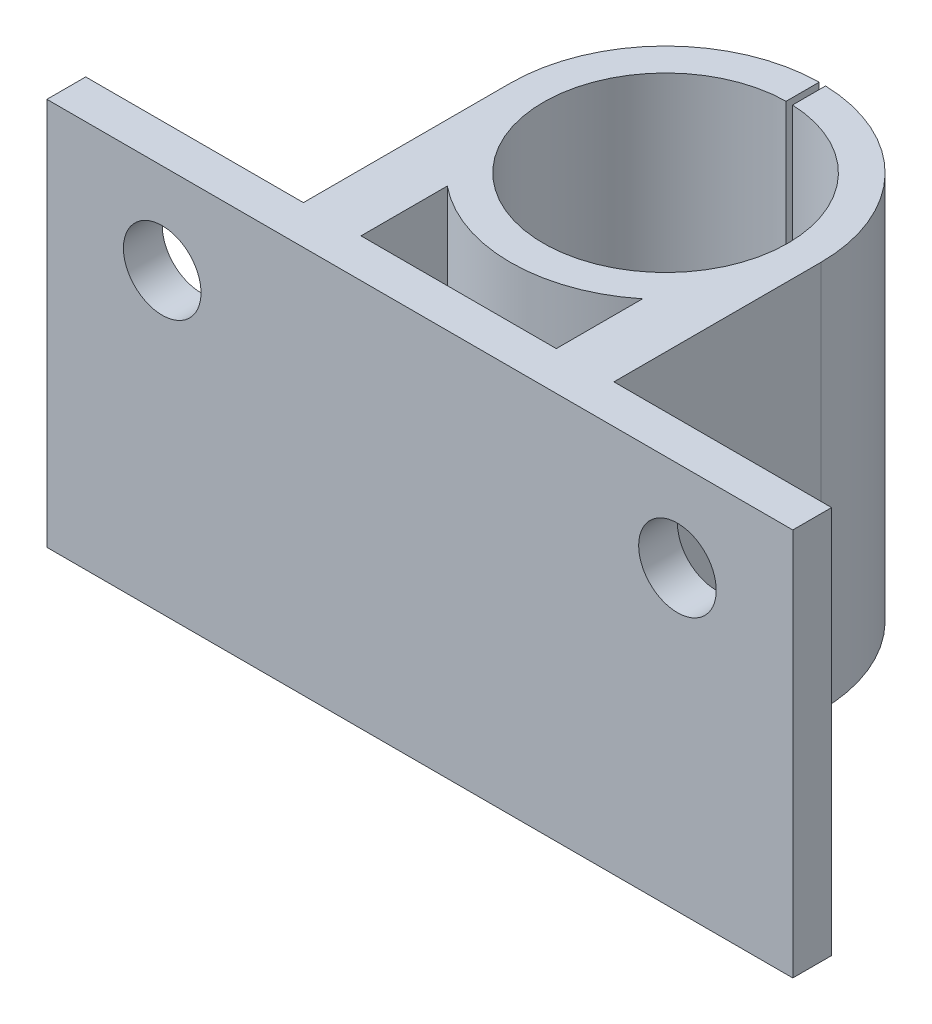
ISO-10303-21;
HEADER;
FILE_DESCRIPTION(('STEP AP214'),'2;1');
FILE_NAME('part.step','',(''),(''),'','','');
FILE_SCHEMA(('AUTOMOTIVE_DESIGN { 1 0 10303 214 1 1 1 1 }'));
ENDSEC;
DATA;
#1=APPLICATION_CONTEXT('core data for automotive mechanical design processes');
#2=APPLICATION_PROTOCOL_DEFINITION('international standard','automotive_design',2000,#1);
#3=PRODUCT_CONTEXT('',#1,'mechanical');
#4=PRODUCT('Part','Part','',(#3));
#5=PRODUCT_RELATED_PRODUCT_CATEGORY('part','',(#4));
#6=PRODUCT_DEFINITION_FORMATION('','',#4);
#7=PRODUCT_DEFINITION_CONTEXT('part definition',#1,'design');
#8=PRODUCT_DEFINITION('design','',#6,#7);
#9=PRODUCT_DEFINITION_SHAPE('','',#8);
#10=(LENGTH_UNIT() NAMED_UNIT(*) SI_UNIT(.MILLI.,.METRE.));
#11=(NAMED_UNIT(*) PLANE_ANGLE_UNIT() SI_UNIT($,.RADIAN.));
#12=(NAMED_UNIT(*) SI_UNIT($,.STERADIAN.) SOLID_ANGLE_UNIT());
#13=UNCERTAINTY_MEASURE_WITH_UNIT(LENGTH_MEASURE(1.E-05),#10,'distance_accuracy_value','');
#14=(GEOMETRIC_REPRESENTATION_CONTEXT(3) GLOBAL_UNCERTAINTY_ASSIGNED_CONTEXT((#13)) GLOBAL_UNIT_ASSIGNED_CONTEXT((#10,
#11,#12)) REPRESENTATION_CONTEXT('',''));
#15=CARTESIAN_POINT('',(0.,0.,0.));
#16=DIRECTION('',(0.,0.,1.));
#17=DIRECTION('',(1.,0.,0.));
#18=AXIS2_PLACEMENT_3D('',#15,#16,#17);
#19=CARTESIAN_POINT('',(0.,0.,-3.99999999999992));
#20=DIRECTION('',(0.,1.,0.));
#21=DIRECTION('',(0.,0.,1.));
#22=AXIS2_PLACEMENT_3D('',#19,#20,#21);
#23=CYLINDRICAL_SURFACE('',#22,12.0019466748902);
#24=DIRECTION('',(0.,1.,0.));
#25=VECTOR('',#24,1.);
#26=CARTESIAN_POINT('',(0.371996235375982,0.,-15.9961803415826));
#27=LINE('',#26,#25);
#28=CARTESIAN_POINT('',(0.371996235375982,30.,-15.9961803415826));
#29=VERTEX_POINT('',#28);
#30=CARTESIAN_POINT('',(0.371996235375982,0.,-15.9961803415826));
#31=VERTEX_POINT('',#30);
#32=EDGE_CURVE('E12',#29,#31,#27,.F.);
#33=ORIENTED_EDGE('',*,*,#32,.F.);
#34=CARTESIAN_POINT('',(0.,30.,-3.99999999999992));
#35=DIRECTION('',(0.,1.,0.));
#36=DIRECTION('',(0.,0.,1.));
#37=AXIS2_PLACEMENT_3D('',#34,#35,#36);
#38=CIRCLE('',#37,12.0019466748902);
#39=CARTESIAN_POINT('',(12.0019466748901,30.,-3.99999999999992));
#40=VERTEX_POINT('',#39);
#41=EDGE_CURVE('E391',#40,#29,#38,.T.);
#42=ORIENTED_EDGE('',*,*,#41,.F.);
#43=DIRECTION('',(0.,1.,0.));
#44=VECTOR('',#43,1.);
#45=CARTESIAN_POINT('',(12.0019466748901,0.,-3.99999999999992));
#46=LINE('',#45,#44);
#47=CARTESIAN_POINT('',(12.0019466748901,0.,-3.99999999999992));
#48=VERTEX_POINT('',#47);
#49=EDGE_CURVE('E533',#48,#40,#46,.T.);
#50=ORIENTED_EDGE('',*,*,#49,.F.);
#51=CARTESIAN_POINT('',(0.,0.,-3.99999999999992));
#52=DIRECTION('',(0.,1.,0.));
#53=DIRECTION('',(0.,0.,1.));
#54=AXIS2_PLACEMENT_3D('',#51,#52,#53);
#55=CIRCLE('',#54,12.0019466748902);
#56=EDGE_CURVE('E582',#48,#31,#55,.T.);
#57=ORIENTED_EDGE('',*,*,#56,.T.);
#58=EDGE_LOOP('',(#33,#42,#50,#57));
#59=FACE_BOUND('',#58,.T.);
#60=ADVANCED_FACE('F259',(#59),#23,.T.);
#61=CARTESIAN_POINT('',(0.,0.,12.));
#62=DIRECTION('',(0.,0.,1.));
#63=DIRECTION('',(1.,0.,0.));
#64=AXIS2_PLACEMENT_3D('',#61,#62,#63);
#65=PLANE('',#64);
#66=CARTESIAN_POINT('',(19.9169611307421,23.,12.));
#67=DIRECTION('',(0.,0.,-1.));
#68=DIRECTION('',(-1.,0.,0.));
#69=AXIS2_PLACEMENT_3D('',#66,#67,#68);
#70=CIRCLE('',#69,3.);
#71=CARTESIAN_POINT('',(16.9169611307421,23.,12.));
#72=VERTEX_POINT('',#71);
#73=EDGE_CURVE('E415',#72,#72,#70,.T.);
#74=ORIENTED_EDGE('',*,*,#73,.F.);
#75=EDGE_LOOP('',(#74));
#76=FACE_BOUND('',#75,.T.);
#77=DIRECTION('',(0.,1.,0.));
#78=VECTOR('',#77,1.);
#79=CARTESIAN_POINT('',(12.0019466748901,0.,12.));
#80=LINE('',#79,#78);
#81=CARTESIAN_POINT('',(12.0019466748901,0.,12.));
#82=VERTEX_POINT('',#81);
#83=CARTESIAN_POINT('',(12.0019466748901,30.,12.));
#84=VERTEX_POINT('',#83);
#85=EDGE_CURVE('E536',#82,#84,#80,.T.);
#86=ORIENTED_EDGE('',*,*,#85,.T.);
#87=DIRECTION('',(1.,0.,0.));
#88=VECTOR('',#87,1.);
#89=CARTESIAN_POINT('',(0.,30.,12.));
#90=LINE('',#89,#88);
#91=CARTESIAN_POINT('',(28.8339222614841,30.,12.));
#92=VERTEX_POINT('',#91);
#93=EDGE_CURVE('E414',#84,#92,#90,.T.);
#94=ORIENTED_EDGE('',*,*,#93,.T.);
#95=DIRECTION('',(0.,1.,0.));
#96=VECTOR('',#95,1.);
#97=CARTESIAN_POINT('',(28.8339222614841,0.,12.));
#98=LINE('',#97,#96);
#99=CARTESIAN_POINT('',(28.8339222614841,0.,12.));
#100=VERTEX_POINT('',#99);
#101=EDGE_CURVE('E429',#100,#92,#98,.T.);
#102=ORIENTED_EDGE('',*,*,#101,.F.);
#103=DIRECTION('',(1.,0.,0.));
#104=VECTOR('',#103,1.);
#105=CARTESIAN_POINT('',(0.,0.,12.));
#106=LINE('',#105,#104);
#107=EDGE_CURVE('E426',#82,#100,#106,.T.);
#108=ORIENTED_EDGE('',*,*,#107,.F.);
#109=EDGE_LOOP('',(#86,#94,#102,#108));
#110=FACE_BOUND('',#109,.T.);
#111=ADVANCED_FACE('F609',(#76,#110),#65,.F.);
#112=CARTESIAN_POINT('',(0.,30.,0.));
#113=DIRECTION('',(0.,1.,0.));
#114=DIRECTION('',(0.,0.,1.));
#115=AXIS2_PLACEMENT_3D('',#112,#113,#114);
#116=PLANE('',#115);
#117=DIRECTION('',(0.,0.,-1.));
#118=VECTOR('',#117,1.);
#119=CARTESIAN_POINT('',(0.371996235375982,30.,-12.0018569478158));
#120=LINE('',#119,#118);
#121=CARTESIAN_POINT('',(0.371996235375982,30.,-13.4426754048238));
#122=VERTEX_POINT('',#121);
#123=EDGE_CURVE('E282',#122,#29,#120,.T.);
#124=ORIENTED_EDGE('',*,*,#123,.F.);
#125=CARTESIAN_POINT('',(0.,30.,-3.99999999999992));
#126=DIRECTION('',(0.,1.,0.));
#127=DIRECTION('',(0.,0.,1.));
#128=AXIS2_PLACEMENT_3D('',#125,#126,#127);
#129=CIRCLE('',#128,9.45);
#130=CARTESIAN_POINT('',(-0.128003764624018,30.,-13.4491330309315));
#131=VERTEX_POINT('',#130);
#132=EDGE_CURVE('E388',#131,#122,#129,.T.);
#133=ORIENTED_EDGE('',*,*,#132,.F.);
#134=DIRECTION('',(0.,0.,1.));
#135=VECTOR('',#134,1.);
#136=CARTESIAN_POINT('',(-0.128003764624018,30.,-12.0018569478158));
#137=LINE('',#136,#135);
#138=CARTESIAN_POINT('',(-0.128003764624018,30.,-16.0012640593876));
#139=VERTEX_POINT('',#138);
#140=EDGE_CURVE('E393',#139,#131,#137,.T.);
#141=ORIENTED_EDGE('',*,*,#140,.F.);
#142=CARTESIAN_POINT('',(-12.0019466748902,30.,-3.99999999999992));
#143=VERTEX_POINT('',#142);
#144=EDGE_CURVE('E508',#139,#143,#38,.T.);
#145=ORIENTED_EDGE('',*,*,#144,.T.);
#146=DIRECTION('',(0.,0.,1.));
#147=VECTOR('',#146,1.);
#148=CARTESIAN_POINT('',(-12.0019466748902,30.,0.));
#149=LINE('',#148,#147);
#150=CARTESIAN_POINT('',(-12.0019466748902,30.,12.));
#151=VERTEX_POINT('',#150);
#152=EDGE_CURVE('E521',#143,#151,#149,.T.);
#153=ORIENTED_EDGE('',*,*,#152,.T.);
#154=DIRECTION('',(1.,0.,0.));
#155=VECTOR('',#154,1.);
#156=CARTESIAN_POINT('',(0.,30.,12.));
#157=LINE('',#156,#155);
#158=CARTESIAN_POINT('',(-28.8339222614841,30.,12.));
#159=VERTEX_POINT('',#158);
#160=EDGE_CURVE('E461',#159,#151,#157,.T.);
#161=ORIENTED_EDGE('',*,*,#160,.F.);
#162=DIRECTION('',(0.,0.,1.));
#163=VECTOR('',#162,1.);
#164=CARTESIAN_POINT('',(-28.8339222614841,30.,-15.));
#165=LINE('',#164,#163);
#166=CARTESIAN_POINT('',(-28.8339222614841,30.,15.));
#167=VERTEX_POINT('',#166);
#168=EDGE_CURVE('E480',#159,#167,#165,.T.);
#169=ORIENTED_EDGE('',*,*,#168,.T.);
#170=DIRECTION('',(1.,0.,0.));
#171=VECTOR('',#170,1.);
#172=CARTESIAN_POINT('',(-28.8339222614841,30.,15.));
#173=LINE('',#172,#171);
#174=CARTESIAN_POINT('',(28.8339222614841,30.,15.));
#175=VERTEX_POINT('',#174);
#176=EDGE_CURVE('E484',#167,#175,#173,.T.);
#177=ORIENTED_EDGE('',*,*,#176,.T.);
#178=DIRECTION('',(0.,0.,-1.));
#179=VECTOR('',#178,1.);
#180=CARTESIAN_POINT('',(28.8339222614841,30.,-15.));
#181=LINE('',#180,#179);
#182=EDGE_CURVE('E476',#175,#92,#181,.T.);
#183=ORIENTED_EDGE('',*,*,#182,.T.);
#184=ORIENTED_EDGE('',*,*,#93,.F.);
#185=DIRECTION('',(0.,0.,1.));
#186=VECTOR('',#185,1.);
#187=CARTESIAN_POINT('',(12.0019466748901,30.,0.));
#188=LINE('',#187,#186);
#189=EDGE_CURVE('E517',#40,#84,#188,.T.);
#190=ORIENTED_EDGE('',*,*,#189,.F.);
#191=ORIENTED_EDGE('',*,*,#41,.T.);
#192=EDGE_LOOP('',(#124,#133,#141,#145,#153,#161,#169,#177,#183,#184,#190,#191));
#193=FACE_BOUND('',#192,.T.);
#194=DIRECTION('',(0.,0.,-1.));
#195=VECTOR('',#194,1.);
#196=CARTESIAN_POINT('',(7.54983443527077,30.,0.));
#197=LINE('',#196,#195);
#198=CARTESIAN_POINT('',(7.54983443527077,30.,12.));
#199=VERTEX_POINT('',#198);
#200=CARTESIAN_POINT('',(7.54983443527077,30.,5.32988338549352));
#201=VERTEX_POINT('',#200);
#202=EDGE_CURVE('E440',#199,#201,#197,.T.);
#203=ORIENTED_EDGE('',*,*,#202,.F.);
#204=DIRECTION('',(1.,0.,0.));
#205=VECTOR('',#204,1.);
#206=CARTESIAN_POINT('',(0.,30.,12.));
#207=LINE('',#206,#205);
#208=CARTESIAN_POINT('',(-7.54983443527089,30.,12.));
#209=VERTEX_POINT('',#208);
#210=EDGE_CURVE('E451',#209,#199,#207,.T.);
#211=ORIENTED_EDGE('',*,*,#210,.F.);
#212=DIRECTION('',(0.,0.,1.));
#213=VECTOR('',#212,1.);
#214=CARTESIAN_POINT('',(-7.54983443527089,30.,0.));
#215=LINE('',#214,#213);
#216=CARTESIAN_POINT('',(-7.54983443527089,30.,5.32988338549351));
#217=VERTEX_POINT('',#216);
#218=EDGE_CURVE('E435',#217,#209,#215,.T.);
#219=ORIENTED_EDGE('',*,*,#218,.F.);
#220=CARTESIAN_POINT('',(0.,30.,-3.99999999999992));
#221=DIRECTION('',(0.,1.,0.));
#222=DIRECTION('',(0.,0.,1.));
#223=AXIS2_PLACEMENT_3D('',#220,#221,#222);
#224=CIRCLE('',#223,12.0019466748902);
#225=EDGE_CURVE('E379',#217,#201,#224,.T.);
#226=ORIENTED_EDGE('',*,*,#225,.T.);
#227=EDGE_LOOP('',(#203,#211,#219,#226));
#228=FACE_BOUND('',#227,.T.);
#229=ADVANCED_FACE('F385',(#193,#228),#116,.T.);
#230=CARTESIAN_POINT('',(0.,0.,0.));
#231=DIRECTION('',(0.,1.,0.));
#232=DIRECTION('',(0.,0.,1.));
#233=AXIS2_PLACEMENT_3D('',#230,#231,#232);
#234=PLANE('',#233);
#235=DIRECTION('',(1.,0.,0.));
#236=VECTOR('',#235,1.);
#237=CARTESIAN_POINT('',(0.,0.,12.));
#238=LINE('',#237,#236);
#239=CARTESIAN_POINT('',(-7.54983443527089,0.,12.));
#240=VERTEX_POINT('',#239);
#241=CARTESIAN_POINT('',(7.54983443527077,0.,12.));
#242=VERTEX_POINT('',#241);
#243=EDGE_CURVE('E439',#240,#242,#238,.T.);
#244=ORIENTED_EDGE('',*,*,#243,.T.);
#245=DIRECTION('',(0.,0.,-1.));
#246=VECTOR('',#245,1.);
#247=CARTESIAN_POINT('',(7.54983443527077,0.,0.));
#248=LINE('',#247,#246);
#249=CARTESIAN_POINT('',(7.54983443527077,0.,5.32988338549352));
#250=VERTEX_POINT('',#249);
#251=EDGE_CURVE('E444',#242,#250,#248,.T.);
#252=ORIENTED_EDGE('',*,*,#251,.T.);
#253=CARTESIAN_POINT('',(0.,0.,-3.99999999999992));
#254=DIRECTION('',(0.,1.,0.));
#255=DIRECTION('',(0.,0.,1.));
#256=AXIS2_PLACEMENT_3D('',#253,#254,#255);
#257=CIRCLE('',#256,12.0019466748902);
#258=CARTESIAN_POINT('',(-7.54983443527089,0.,5.32988338549351));
#259=VERTEX_POINT('',#258);
#260=EDGE_CURVE('E522',#259,#250,#257,.T.);
#261=ORIENTED_EDGE('',*,*,#260,.F.);
#262=DIRECTION('',(0.,0.,1.));
#263=VECTOR('',#262,1.);
#264=CARTESIAN_POINT('',(-7.54983443527089,0.,0.));
#265=LINE('',#264,#263);
#266=EDGE_CURVE('E436',#259,#240,#265,.T.);
#267=ORIENTED_EDGE('',*,*,#266,.T.);
#268=EDGE_LOOP('',(#244,#252,#261,#267));
#269=FACE_BOUND('',#268,.T.);
#270=CARTESIAN_POINT('',(0.,0.,-3.99999999999992));
#271=DIRECTION('',(0.,1.,0.));
#272=DIRECTION('',(0.,0.,1.));
#273=AXIS2_PLACEMENT_3D('',#270,#271,#272);
#274=CIRCLE('',#273,9.45);
#275=CARTESIAN_POINT('',(-0.128003764624018,0.,-13.4491330309315));
#276=VERTEX_POINT('',#275);
#277=CARTESIAN_POINT('',(0.371996235375982,0.,-13.4426754048238));
#278=VERTEX_POINT('',#277);
#279=EDGE_CURVE('E398',#276,#278,#274,.T.);
#280=ORIENTED_EDGE('',*,*,#279,.T.);
#281=DIRECTION('',(0.,0.,-1.));
#282=VECTOR('',#281,1.);
#283=CARTESIAN_POINT('',(0.371996235375982,0.,-12.0018569478158));
#284=LINE('',#283,#282);
#285=EDGE_CURVE('E373',#278,#31,#284,.T.);
#286=ORIENTED_EDGE('',*,*,#285,.T.);
#287=ORIENTED_EDGE('',*,*,#56,.F.);
#288=DIRECTION('',(0.,0.,1.));
#289=VECTOR('',#288,1.);
#290=CARTESIAN_POINT('',(12.0019466748901,0.,0.));
#291=LINE('',#290,#289);
#292=EDGE_CURVE('E527',#48,#82,#291,.T.);
#293=ORIENTED_EDGE('',*,*,#292,.T.);
#294=ORIENTED_EDGE('',*,*,#107,.T.);
#295=DIRECTION('',(0.,0.,-1.));
#296=VECTOR('',#295,1.);
#297=CARTESIAN_POINT('',(28.8339222614841,0.,-15.));
#298=LINE('',#297,#296);
#299=CARTESIAN_POINT('',(28.8339222614841,0.,15.));
#300=VERTEX_POINT('',#299);
#301=EDGE_CURVE('E475',#300,#100,#298,.T.);
#302=ORIENTED_EDGE('',*,*,#301,.F.);
#303=DIRECTION('',(1.,0.,0.));
#304=VECTOR('',#303,1.);
#305=CARTESIAN_POINT('',(-28.8339222614841,0.,15.));
#306=LINE('',#305,#304);
#307=CARTESIAN_POINT('',(-28.8339222614841,0.,15.));
#308=VERTEX_POINT('',#307);
#309=EDGE_CURVE('E481',#308,#300,#306,.T.);
#310=ORIENTED_EDGE('',*,*,#309,.F.);
#311=DIRECTION('',(0.,0.,1.));
#312=VECTOR('',#311,1.);
#313=CARTESIAN_POINT('',(-28.8339222614841,0.,-15.));
#314=LINE('',#313,#312);
#315=CARTESIAN_POINT('',(-28.8339222614841,0.,12.));
#316=VERTEX_POINT('',#315);
#317=EDGE_CURVE('E491',#316,#308,#314,.T.);
#318=ORIENTED_EDGE('',*,*,#317,.F.);
#319=DIRECTION('',(1.,0.,0.));
#320=VECTOR('',#319,1.);
#321=CARTESIAN_POINT('',(0.,0.,12.));
#322=LINE('',#321,#320);
#323=CARTESIAN_POINT('',(-12.0019466748902,0.,12.));
#324=VERTEX_POINT('',#323);
#325=EDGE_CURVE('E465',#316,#324,#322,.T.);
#326=ORIENTED_EDGE('',*,*,#325,.T.);
#327=DIRECTION('',(0.,0.,1.));
#328=VECTOR('',#327,1.);
#329=CARTESIAN_POINT('',(-12.0019466748902,0.,0.));
#330=LINE('',#329,#328);
#331=CARTESIAN_POINT('',(-12.0019466748902,0.,-3.99999999999992));
#332=VERTEX_POINT('',#331);
#333=EDGE_CURVE('E543',#332,#324,#330,.T.);
#334=ORIENTED_EDGE('',*,*,#333,.F.);
#335=CARTESIAN_POINT('',(-0.128003764624018,0.,-16.0012640593876));
#336=VERTEX_POINT('',#335);
#337=EDGE_CURVE('E572',#336,#332,#55,.T.);
#338=ORIENTED_EDGE('',*,*,#337,.F.);
#339=DIRECTION('',(0.,0.,1.));
#340=VECTOR('',#339,1.);
#341=CARTESIAN_POINT('',(-0.128003764624018,0.,-12.0018569478158));
#342=LINE('',#341,#340);
#343=EDGE_CURVE('E275',#336,#276,#342,.T.);
#344=ORIENTED_EDGE('',*,*,#343,.T.);
#345=EDGE_LOOP('',(#280,#286,#287,#293,#294,#302,#310,#318,#326,#334,#338,#344));
#346=FACE_BOUND('',#345,.T.);
#347=ADVANCED_FACE('F565',(#269,#346),#234,.F.);
#348=CARTESIAN_POINT('',(28.8339222614841,30.,-15.));
#349=DIRECTION('',(-1.,0.,0.));
#350=DIRECTION('',(0.,0.,1.));
#351=AXIS2_PLACEMENT_3D('',#348,#349,#350);
#352=PLANE('',#351);
#353=ORIENTED_EDGE('',*,*,#301,.T.);
#354=ORIENTED_EDGE('',*,*,#101,.T.);
#355=ORIENTED_EDGE('',*,*,#182,.F.);
#356=DIRECTION('',(0.,-1.,0.));
#357=VECTOR('',#356,1.);
#358=CARTESIAN_POINT('',(28.8339222614841,30.,15.));
#359=LINE('',#358,#357);
#360=EDGE_CURVE('E487',#175,#300,#359,.T.);
#361=ORIENTED_EDGE('',*,*,#360,.T.);
#362=EDGE_LOOP('',(#353,#354,#355,#361));
#363=FACE_BOUND('',#362,.T.);
#364=ADVANCED_FACE('F261',(#363),#352,.F.);
#365=CARTESIAN_POINT('',(-28.8339222614841,30.,-15.));
#366=DIRECTION('',(1.,0.,0.));
#367=DIRECTION('',(0.,0.,-1.));
#368=AXIS2_PLACEMENT_3D('',#365,#366,#367);
#369=PLANE('',#368);
#370=ORIENTED_EDGE('',*,*,#168,.F.);
#371=DIRECTION('',(0.,1.,0.));
#372=VECTOR('',#371,1.);
#373=CARTESIAN_POINT('',(-28.8339222614841,0.,12.));
#374=LINE('',#373,#372);
#375=EDGE_CURVE('E469',#316,#159,#374,.T.);
#376=ORIENTED_EDGE('',*,*,#375,.F.);
#377=ORIENTED_EDGE('',*,*,#317,.T.);
#378=DIRECTION('',(0.,-1.,0.));
#379=VECTOR('',#378,1.);
#380=CARTESIAN_POINT('',(-28.8339222614841,30.,15.));
#381=LINE('',#380,#379);
#382=EDGE_CURVE('E499',#167,#308,#381,.T.);
#383=ORIENTED_EDGE('',*,*,#382,.F.);
#384=EDGE_LOOP('',(#370,#376,#377,#383));
#385=FACE_BOUND('',#384,.T.);
#386=ADVANCED_FACE('F598',(#385),#369,.F.);
#387=CARTESIAN_POINT('',(-28.8339222614841,30.,15.));
#388=DIRECTION('',(0.,0.,-1.));
#389=DIRECTION('',(-1.,0.,0.));
#390=AXIS2_PLACEMENT_3D('',#387,#388,#389);
#391=PLANE('',#390);
#392=CARTESIAN_POINT('',(19.9169611307421,23.,15.));
#393=DIRECTION('',(0.,0.,-1.));
#394=DIRECTION('',(-1.,0.,0.));
#395=AXIS2_PLACEMENT_3D('',#392,#393,#394);
#396=CIRCLE('',#395,3.);
#397=CARTESIAN_POINT('',(16.9169611307421,23.,15.));
#398=VERTEX_POINT('',#397);
#399=EDGE_CURVE('E410',#398,#398,#396,.T.);
#400=ORIENTED_EDGE('',*,*,#399,.T.);
#401=EDGE_LOOP('',(#400));
#402=FACE_BOUND('',#401,.T.);
#403=CARTESIAN_POINT('',(-19.9169611307421,23.,15.));
#404=DIRECTION('',(0.,0.,-1.));
#405=DIRECTION('',(-1.,0.,0.));
#406=AXIS2_PLACEMENT_3D('',#403,#404,#405);
#407=CIRCLE('',#406,3.);
#408=CARTESIAN_POINT('',(-22.9169611307421,23.,15.));
#409=VERTEX_POINT('',#408);
#410=EDGE_CURVE('E419',#409,#409,#407,.T.);
#411=ORIENTED_EDGE('',*,*,#410,.T.);
#412=EDGE_LOOP('',(#411));
#413=FACE_BOUND('',#412,.T.);
#414=ORIENTED_EDGE('',*,*,#309,.T.);
#415=ORIENTED_EDGE('',*,*,#360,.F.);
#416=ORIENTED_EDGE('',*,*,#176,.F.);
#417=ORIENTED_EDGE('',*,*,#382,.T.);
#418=EDGE_LOOP('',(#414,#415,#416,#417));
#419=FACE_BOUND('',#418,.T.);
#420=ADVANCED_FACE('F601',(#402,#413,#419),#391,.F.);
#421=CARTESIAN_POINT('',(0.,0.,12.));
#422=DIRECTION('',(0.,0.,1.));
#423=DIRECTION('',(1.,0.,0.));
#424=AXIS2_PLACEMENT_3D('',#421,#422,#423);
#425=PLANE('',#424);
#426=CARTESIAN_POINT('',(-19.9169611307421,23.,12.));
#427=DIRECTION('',(0.,0.,-1.));
#428=DIRECTION('',(-1.,0.,0.));
#429=AXIS2_PLACEMENT_3D('',#426,#427,#428);
#430=CIRCLE('',#429,3.);
#431=CARTESIAN_POINT('',(-22.9169611307421,23.,12.));
#432=VERTEX_POINT('',#431);
#433=EDGE_CURVE('E403',#432,#432,#430,.T.);
#434=ORIENTED_EDGE('',*,*,#433,.F.);
#435=EDGE_LOOP('',(#434));
#436=FACE_BOUND('',#435,.T.);
#437=ORIENTED_EDGE('',*,*,#160,.T.);
#438=DIRECTION('',(0.,1.,0.));
#439=VECTOR('',#438,1.);
#440=CARTESIAN_POINT('',(-12.0019466748902,0.,12.));
#441=LINE('',#440,#439);
#442=EDGE_CURVE('E406',#324,#151,#441,.T.);
#443=ORIENTED_EDGE('',*,*,#442,.F.);
#444=ORIENTED_EDGE('',*,*,#325,.F.);
#445=ORIENTED_EDGE('',*,*,#375,.T.);
#446=EDGE_LOOP('',(#437,#443,#444,#445));
#447=FACE_BOUND('',#446,.T.);
#448=ADVANCED_FACE('F589',(#436,#447),#425,.F.);
#449=CARTESIAN_POINT('',(7.54983443527077,0.,0.));
#450=DIRECTION('',(1.,0.,0.));
#451=DIRECTION('',(0.,0.,-1.));
#452=AXIS2_PLACEMENT_3D('',#449,#450,#451);
#453=PLANE('',#452);
#454=ORIENTED_EDGE('',*,*,#202,.T.);
#455=DIRECTION('',(0.,1.,0.));
#456=VECTOR('',#455,1.);
#457=CARTESIAN_POINT('',(7.54983443527077,0.,5.32988338549352));
#458=LINE('',#457,#456);
#459=EDGE_CURVE('E540',#250,#201,#458,.T.);
#460=ORIENTED_EDGE('',*,*,#459,.F.);
#461=ORIENTED_EDGE('',*,*,#251,.F.);
#462=DIRECTION('',(0.,1.,0.));
#463=VECTOR('',#462,1.);
#464=CARTESIAN_POINT('',(7.54983443527077,0.,12.));
#465=LINE('',#464,#463);
#466=EDGE_CURVE('E458',#242,#199,#465,.T.);
#467=ORIENTED_EDGE('',*,*,#466,.T.);
#468=EDGE_LOOP('',(#454,#460,#461,#467));
#469=FACE_BOUND('',#468,.T.);
#470=ADVANCED_FACE('F553',(#469),#453,.F.);
#471=CARTESIAN_POINT('',(0.,0.,12.));
#472=DIRECTION('',(0.,0.,1.));
#473=DIRECTION('',(1.,0.,0.));
#474=AXIS2_PLACEMENT_3D('',#471,#472,#473);
#475=PLANE('',#474);
#476=ORIENTED_EDGE('',*,*,#210,.T.);
#477=ORIENTED_EDGE('',*,*,#466,.F.);
#478=ORIENTED_EDGE('',*,*,#243,.F.);
#479=DIRECTION('',(0.,1.,0.));
#480=VECTOR('',#479,1.);
#481=CARTESIAN_POINT('',(-7.54983443527089,0.,12.));
#482=LINE('',#481,#480);
#483=EDGE_CURVE('E448',#240,#209,#482,.T.);
#484=ORIENTED_EDGE('',*,*,#483,.T.);
#485=EDGE_LOOP('',(#476,#477,#478,#484));
#486=FACE_BOUND('',#485,.T.);
#487=ADVANCED_FACE('F557',(#486),#475,.F.);
#488=CARTESIAN_POINT('',(-7.54983443527089,0.,0.));
#489=DIRECTION('',(-1.,0.,0.));
#490=DIRECTION('',(0.,0.,1.));
#491=AXIS2_PLACEMENT_3D('',#488,#489,#490);
#492=PLANE('',#491);
#493=ORIENTED_EDGE('',*,*,#266,.F.);
#494=DIRECTION('',(0.,1.,0.));
#495=VECTOR('',#494,1.);
#496=CARTESIAN_POINT('',(-7.54983443527089,0.,5.32988338549351));
#497=LINE('',#496,#495);
#498=EDGE_CURVE('E399',#259,#217,#497,.T.);
#499=ORIENTED_EDGE('',*,*,#498,.T.);
#500=ORIENTED_EDGE('',*,*,#218,.T.);
#501=ORIENTED_EDGE('',*,*,#483,.F.);
#502=EDGE_LOOP('',(#493,#499,#500,#501));
#503=FACE_BOUND('',#502,.T.);
#504=ADVANCED_FACE('F561',(#503),#492,.F.);
#505=CARTESIAN_POINT('',(19.9169611307421,23.,15.));
#506=DIRECTION('',(0.,0.,-1.));
#507=DIRECTION('',(-1.,0.,0.));
#508=AXIS2_PLACEMENT_3D('',#505,#506,#507);
#509=CYLINDRICAL_SURFACE('',#508,3.);
#510=ORIENTED_EDGE('',*,*,#399,.F.);
#511=EDGE_LOOP('',(#510));
#512=FACE_BOUND('',#511,.T.);
#513=ORIENTED_EDGE('',*,*,#73,.T.);
#514=EDGE_LOOP('',(#513));
#515=FACE_BOUND('',#514,.T.);
#516=ADVANCED_FACE('F735',(#512,#515),#509,.F.);
#517=CARTESIAN_POINT('',(-19.9169611307421,23.,15.));
#518=DIRECTION('',(0.,0.,-1.));
#519=DIRECTION('',(-1.,0.,0.));
#520=AXIS2_PLACEMENT_3D('',#517,#518,#519);
#521=CYLINDRICAL_SURFACE('',#520,3.);
#522=ORIENTED_EDGE('',*,*,#410,.F.);
#523=EDGE_LOOP('',(#522));
#524=FACE_BOUND('',#523,.T.);
#525=ORIENTED_EDGE('',*,*,#433,.T.);
#526=EDGE_LOOP('',(#525));
#527=FACE_BOUND('',#526,.T.);
#528=ADVANCED_FACE('F741',(#524,#527),#521,.F.);
#529=CARTESIAN_POINT('',(0.,0.,-3.99999999999992));
#530=DIRECTION('',(0.,1.,0.));
#531=DIRECTION('',(0.,0.,1.));
#532=AXIS2_PLACEMENT_3D('',#529,#530,#531);
#533=CYLINDRICAL_SURFACE('',#532,9.45);
#534=ORIENTED_EDGE('',*,*,#132,.T.);
#535=DIRECTION('',(0.,1.,0.));
#536=VECTOR('',#535,1.);
#537=CARTESIAN_POINT('',(0.371996235375982,0.,-13.4426754048238));
#538=LINE('',#537,#536);
#539=EDGE_CURVE('E370',#122,#278,#538,.F.);
#540=ORIENTED_EDGE('',*,*,#539,.T.);
#541=ORIENTED_EDGE('',*,*,#279,.F.);
#542=DIRECTION('',(0.,1.,0.));
#543=VECTOR('',#542,1.);
#544=CARTESIAN_POINT('',(-0.128003764624018,0.,-13.4491330309315));
#545=LINE('',#544,#543);
#546=EDGE_CURVE('E380',#276,#131,#545,.T.);
#547=ORIENTED_EDGE('',*,*,#546,.T.);
#548=EDGE_LOOP('',(#534,#540,#541,#547));
#549=FACE_BOUND('',#548,.T.);
#550=ADVANCED_FACE('F396',(#549),#533,.F.);
#551=CARTESIAN_POINT('',(12.0019466748901,0.,0.));
#552=DIRECTION('',(-1.,0.,0.));
#553=DIRECTION('',(0.,0.,1.));
#554=AXIS2_PLACEMENT_3D('',#551,#552,#553);
#555=PLANE('',#554);
#556=ORIENTED_EDGE('',*,*,#189,.T.);
#557=ORIENTED_EDGE('',*,*,#85,.F.);
#558=ORIENTED_EDGE('',*,*,#292,.F.);
#559=ORIENTED_EDGE('',*,*,#49,.T.);
#560=EDGE_LOOP('',(#556,#557,#558,#559));
#561=FACE_BOUND('',#560,.T.);
#562=ADVANCED_FACE('F613',(#561),#555,.F.);
#563=CARTESIAN_POINT('',(-12.0019466748902,0.,0.));
#564=DIRECTION('',(-1.,0.,0.));
#565=DIRECTION('',(0.,0.,1.));
#566=AXIS2_PLACEMENT_3D('',#563,#564,#565);
#567=PLANE('',#566);
#568=ORIENTED_EDGE('',*,*,#152,.F.);
#569=DIRECTION('',(0.,1.,0.));
#570=VECTOR('',#569,1.);
#571=CARTESIAN_POINT('',(-12.0019466748902,0.,-3.99999999999992));
#572=LINE('',#571,#570);
#573=EDGE_CURVE('E514',#332,#143,#572,.T.);
#574=ORIENTED_EDGE('',*,*,#573,.F.);
#575=ORIENTED_EDGE('',*,*,#333,.T.);
#576=ORIENTED_EDGE('',*,*,#442,.T.);
#577=EDGE_LOOP('',(#568,#574,#575,#576));
#578=FACE_BOUND('',#577,.T.);
#579=ADVANCED_FACE('F587',(#578),#567,.T.);
#580=DIRECTION('',(0.,1.,0.));
#581=VECTOR('',#580,1.);
#582=CARTESIAN_POINT('',(-0.128003764624018,0.,-16.0012640593876));
#583=LINE('',#582,#581);
#584=EDGE_CURVE('E268',#336,#139,#583,.T.);
#585=ORIENTED_EDGE('',*,*,#584,.F.);
#586=ORIENTED_EDGE('',*,*,#337,.T.);
#587=ORIENTED_EDGE('',*,*,#573,.T.);
#588=ORIENTED_EDGE('',*,*,#144,.F.);
#589=EDGE_LOOP('',(#585,#586,#587,#588));
#590=FACE_BOUND('',#589,.T.);
#591=ADVANCED_FACE('F512',(#590),#23,.T.);
#592=CARTESIAN_POINT('',(0.,0.,-3.99999999999992));
#593=DIRECTION('',(0.,1.,0.));
#594=DIRECTION('',(0.,0.,1.));
#595=AXIS2_PLACEMENT_3D('',#592,#593,#594);
#596=CYLINDRICAL_SURFACE('',#595,12.0019466748902);
#597=ORIENTED_EDGE('',*,*,#225,.F.);
#598=ORIENTED_EDGE('',*,*,#498,.F.);
#599=ORIENTED_EDGE('',*,*,#260,.T.);
#600=ORIENTED_EDGE('',*,*,#459,.T.);
#601=EDGE_LOOP('',(#597,#598,#599,#600));
#602=FACE_BOUND('',#601,.T.);
#603=ADVANCED_FACE('F563',(#602),#596,.T.);
#604=CARTESIAN_POINT('',(-0.128003764624018,0.,-12.0018569478158));
#605=DIRECTION('',(-1.,0.,0.));
#606=DIRECTION('',(0.,0.,1.));
#607=AXIS2_PLACEMENT_3D('',#604,#605,#606);
#608=PLANE('',#607);
#609=ORIENTED_EDGE('',*,*,#343,.F.);
#610=ORIENTED_EDGE('',*,*,#584,.T.);
#611=ORIENTED_EDGE('',*,*,#140,.T.);
#612=ORIENTED_EDGE('',*,*,#546,.F.);
#613=EDGE_LOOP('',(#609,#610,#611,#612));
#614=FACE_BOUND('',#613,.T.);
#615=ADVANCED_FACE('F503',(#614),#608,.F.);
#616=CARTESIAN_POINT('',(0.371996235375982,0.,-12.0018569478158));
#617=DIRECTION('',(1.,0.,0.));
#618=DIRECTION('',(0.,0.,-1.));
#619=AXIS2_PLACEMENT_3D('',#616,#617,#618);
#620=PLANE('',#619);
#621=ORIENTED_EDGE('',*,*,#123,.T.);
#622=ORIENTED_EDGE('',*,*,#32,.T.);
#623=ORIENTED_EDGE('',*,*,#285,.F.);
#624=ORIENTED_EDGE('',*,*,#539,.F.);
#625=EDGE_LOOP('',(#621,#622,#623,#624));
#626=FACE_BOUND('',#625,.T.);
#627=ADVANCED_FACE('F371',(#626),#620,.F.);
#628=CLOSED_SHELL('',(#60,#111,#229,#347,#364,#386,#420,#448,#470,#487,#504,#516,#528,#550,#562,
#579,#591,#603,#615,#627));
#629=MANIFOLD_SOLID_BREP('B2',#628);
#630=ADVANCED_BREP_SHAPE_REPRESENTATION('',(#18,#629),#14);
#631=SHAPE_DEFINITION_REPRESENTATION(#9,#630);
ENDSEC;
END-ISO-10303-21;
